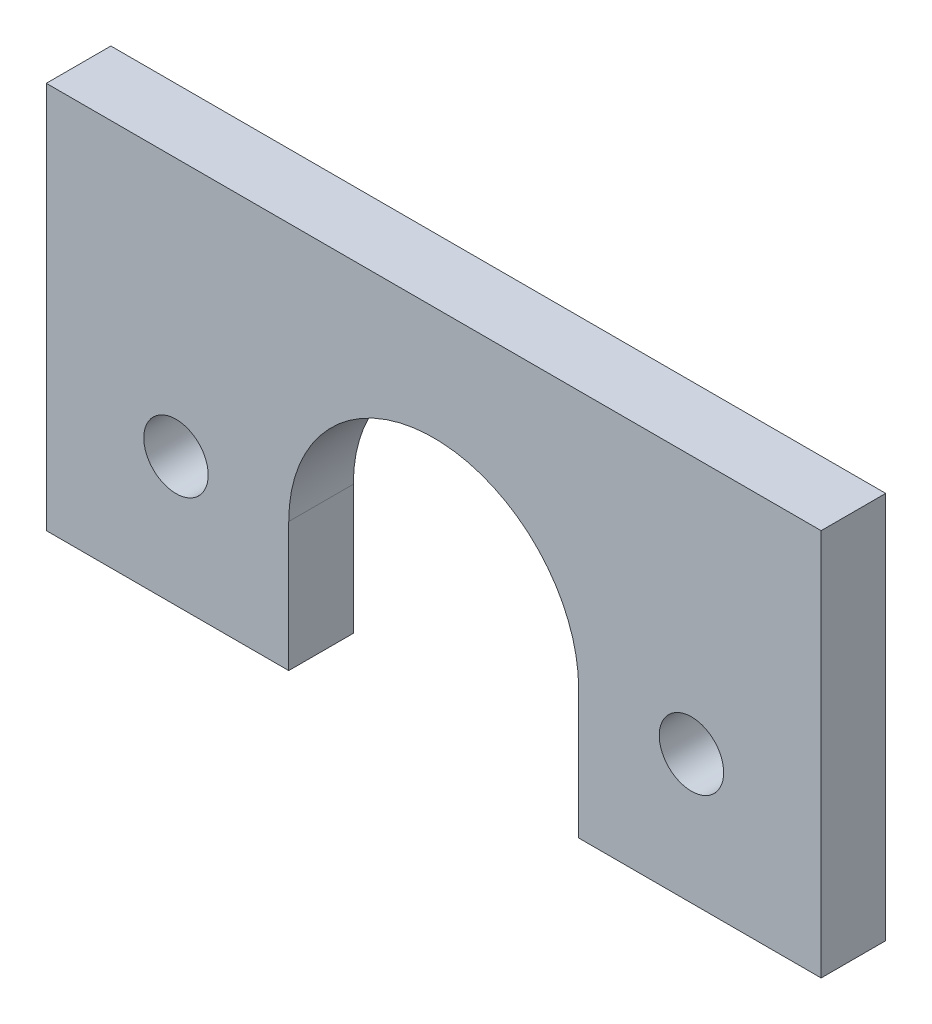
ISO-10303-21;
HEADER;
FILE_DESCRIPTION(('STEP AP214'),'2;1');
FILE_NAME('part.step','',(''),(''),'','','');
FILE_SCHEMA(('AUTOMOTIVE_DESIGN { 1 0 10303 214 1 1 1 1 }'));
ENDSEC;
DATA;
#1=APPLICATION_CONTEXT('core data for automotive mechanical design processes');
#2=APPLICATION_PROTOCOL_DEFINITION('international standard','automotive_design',2000,#1);
#3=PRODUCT_CONTEXT('',#1,'mechanical');
#4=PRODUCT('Part','Part','',(#3));
#5=PRODUCT_RELATED_PRODUCT_CATEGORY('part','',(#4));
#6=PRODUCT_DEFINITION_FORMATION('','',#4);
#7=PRODUCT_DEFINITION_CONTEXT('part definition',#1,'design');
#8=PRODUCT_DEFINITION('design','',#6,#7);
#9=PRODUCT_DEFINITION_SHAPE('','',#8);
#10=(LENGTH_UNIT() NAMED_UNIT(*) SI_UNIT(.MILLI.,.METRE.));
#11=(NAMED_UNIT(*) PLANE_ANGLE_UNIT() SI_UNIT($,.RADIAN.));
#12=(NAMED_UNIT(*) SI_UNIT($,.STERADIAN.) SOLID_ANGLE_UNIT());
#13=UNCERTAINTY_MEASURE_WITH_UNIT(LENGTH_MEASURE(1.E-05),#10,'distance_accuracy_value','');
#14=(GEOMETRIC_REPRESENTATION_CONTEXT(3) GLOBAL_UNCERTAINTY_ASSIGNED_CONTEXT((#13)) GLOBAL_UNIT_ASSIGNED_CONTEXT((#10,
#11,#12)) REPRESENTATION_CONTEXT('',''));
#15=CARTESIAN_POINT('',(0.,0.,0.));
#16=DIRECTION('',(0.,0.,1.));
#17=DIRECTION('',(1.,0.,0.));
#18=AXIS2_PLACEMENT_3D('',#15,#16,#17);
#19=CARTESIAN_POINT('',(-14.2568958463227,0.,6.35));
#20=DIRECTION('',(1.,0.,0.));
#21=DIRECTION('',(0.,1.,0.));
#22=AXIS2_PLACEMENT_3D('',#19,#20,#21);
#23=PLANE('',#22);
#24=DIRECTION('',(0.,-1.,0.));
#25=VECTOR('',#24,1.);
#26=CARTESIAN_POINT('',(-14.2568958463227,0.,0.));
#27=LINE('',#26,#25);
#28=CARTESIAN_POINT('',(-14.2568958463227,0.249783871059959,0.));
#29=VERTEX_POINT('',#28);
#30=CARTESIAN_POINT('',(-14.2568958463227,-12.45021612894,0.));
#31=VERTEX_POINT('',#30);
#32=EDGE_CURVE('E138',#29,#31,#27,.T.);
#33=ORIENTED_EDGE('',*,*,#32,.F.);
#34=DIRECTION('',(0.,0.,-1.));
#35=VECTOR('',#34,1.);
#36=CARTESIAN_POINT('',(-14.2568958463227,0.249783871059959,6.35));
#37=LINE('',#36,#35);
#38=CARTESIAN_POINT('',(-14.2568958463227,0.249783871059959,6.35));
#39=VERTEX_POINT('',#38);
#40=EDGE_CURVE('E11',#39,#29,#37,.T.);
#41=ORIENTED_EDGE('',*,*,#40,.F.);
#42=DIRECTION('',(0.,-1.,0.));
#43=VECTOR('',#42,1.);
#44=CARTESIAN_POINT('',(-14.2568958463227,0.,6.35));
#45=LINE('',#44,#43);
#46=CARTESIAN_POINT('',(-14.2568958463227,-12.45021612894,6.35));
#47=VERTEX_POINT('',#46);
#48=EDGE_CURVE('E161',#39,#47,#45,.T.);
#49=ORIENTED_EDGE('',*,*,#48,.T.);
#50=DIRECTION('',(0.,0.,-1.));
#51=VECTOR('',#50,1.);
#52=CARTESIAN_POINT('',(-14.2568958463227,-12.45021612894,6.35));
#53=LINE('',#52,#51);
#54=EDGE_CURVE('E54',#47,#31,#53,.T.);
#55=ORIENTED_EDGE('',*,*,#54,.T.);
#56=EDGE_LOOP('',(#33,#41,#49,#55));
#57=FACE_BOUND('',#56,.T.);
#58=ADVANCED_FACE('F38',(#57),#23,.T.);
#59=CARTESIAN_POINT('',(0.,0.249783871059959,6.35));
#60=DIRECTION('',(0.,0.,-1.));
#61=DIRECTION('',(-1.,0.,0.));
#62=AXIS2_PLACEMENT_3D('',#59,#60,#61);
#63=CYLINDRICAL_SURFACE('',#62,14.2568958463227);
#64=CARTESIAN_POINT('',(0.,0.249783871059959,0.));
#65=DIRECTION('',(0.,0.,1.));
#66=DIRECTION('',(1.,0.,0.));
#67=AXIS2_PLACEMENT_3D('',#64,#65,#66);
#68=CIRCLE('',#67,14.2568958463227);
#69=CARTESIAN_POINT('',(14.2568958463227,0.249783871059959,0.));
#70=VERTEX_POINT('',#69);
#71=EDGE_CURVE('E140',#29,#70,#68,.F.);
#72=ORIENTED_EDGE('',*,*,#71,.T.);
#73=DIRECTION('',(0.,0.,-1.));
#74=VECTOR('',#73,1.);
#75=CARTESIAN_POINT('',(14.2568958463227,0.249783871059959,6.35));
#76=LINE('',#75,#74);
#77=CARTESIAN_POINT('',(14.2568958463227,0.249783871059959,6.35));
#78=VERTEX_POINT('',#77);
#79=EDGE_CURVE('E46',#78,#70,#76,.T.);
#80=ORIENTED_EDGE('',*,*,#79,.F.);
#81=CARTESIAN_POINT('',(0.,0.249783871059959,6.35));
#82=DIRECTION('',(0.,0.,1.));
#83=DIRECTION('',(1.,0.,0.));
#84=AXIS2_PLACEMENT_3D('',#81,#82,#83);
#85=CIRCLE('',#84,14.2568958463227);
#86=EDGE_CURVE('E195',#39,#78,#85,.F.);
#87=ORIENTED_EDGE('',*,*,#86,.F.);
#88=ORIENTED_EDGE('',*,*,#40,.T.);
#89=EDGE_LOOP('',(#72,#80,#87,#88));
#90=FACE_BOUND('',#89,.T.);
#91=ADVANCED_FACE('F212',(#90),#63,.F.);
#92=CARTESIAN_POINT('',(14.2568958463227,0.,6.35));
#93=DIRECTION('',(1.,0.,0.));
#94=DIRECTION('',(0.,1.,0.));
#95=AXIS2_PLACEMENT_3D('',#92,#93,#94);
#96=PLANE('',#95);
#97=DIRECTION('',(0.,-1.,0.));
#98=VECTOR('',#97,1.);
#99=CARTESIAN_POINT('',(14.2568958463227,0.,0.));
#100=LINE('',#99,#98);
#101=CARTESIAN_POINT('',(14.2568958463227,-12.45021612894,0.));
#102=VERTEX_POINT('',#101);
#103=EDGE_CURVE('E142',#70,#102,#100,.T.);
#104=ORIENTED_EDGE('',*,*,#103,.T.);
#105=DIRECTION('',(0.,0.,-1.));
#106=VECTOR('',#105,1.);
#107=CARTESIAN_POINT('',(14.2568958463227,-12.45021612894,6.35));
#108=LINE('',#107,#106);
#109=CARTESIAN_POINT('',(14.2568958463227,-12.45021612894,6.35));
#110=VERTEX_POINT('',#109);
#111=EDGE_CURVE('E168',#110,#102,#108,.T.);
#112=ORIENTED_EDGE('',*,*,#111,.F.);
#113=DIRECTION('',(0.,-1.,0.));
#114=VECTOR('',#113,1.);
#115=CARTESIAN_POINT('',(14.2568958463227,0.,6.35));
#116=LINE('',#115,#114);
#117=EDGE_CURVE('E177',#78,#110,#116,.T.);
#118=ORIENTED_EDGE('',*,*,#117,.F.);
#119=ORIENTED_EDGE('',*,*,#79,.T.);
#120=EDGE_LOOP('',(#104,#112,#118,#119));
#121=FACE_BOUND('',#120,.T.);
#122=ADVANCED_FACE('F175',(#121),#96,.F.);
#123=CARTESIAN_POINT('',(0.,-12.45021612894,6.35));
#124=DIRECTION('',(0.,1.,0.));
#125=DIRECTION('',(-1.,0.,0.));
#126=AXIS2_PLACEMENT_3D('',#123,#124,#125);
#127=PLANE('',#126);
#128=DIRECTION('',(1.,0.,0.));
#129=VECTOR('',#128,1.);
#130=CARTESIAN_POINT('',(0.,-12.45021612894,0.));
#131=LINE('',#130,#129);
#132=CARTESIAN_POINT('',(38.1,-12.45021612894,0.));
#133=VERTEX_POINT('',#132);
#134=EDGE_CURVE('E144',#102,#133,#131,.T.);
#135=ORIENTED_EDGE('',*,*,#134,.T.);
#136=DIRECTION('',(0.,0.,-1.));
#137=VECTOR('',#136,1.);
#138=CARTESIAN_POINT('',(38.1,-12.45021612894,6.35));
#139=LINE('',#138,#137);
#140=CARTESIAN_POINT('',(38.1,-12.45021612894,6.35));
#141=VERTEX_POINT('',#140);
#142=EDGE_CURVE('E165',#141,#133,#139,.T.);
#143=ORIENTED_EDGE('',*,*,#142,.F.);
#144=DIRECTION('',(1.,0.,0.));
#145=VECTOR('',#144,1.);
#146=CARTESIAN_POINT('',(0.,-12.45021612894,6.35));
#147=LINE('',#146,#145);
#148=EDGE_CURVE('E191',#110,#141,#147,.T.);
#149=ORIENTED_EDGE('',*,*,#148,.F.);
#150=ORIENTED_EDGE('',*,*,#111,.T.);
#151=EDGE_LOOP('',(#135,#143,#149,#150));
#152=FACE_BOUND('',#151,.T.);
#153=ADVANCED_FACE('F187',(#152),#127,.F.);
#154=CARTESIAN_POINT('',(38.1,0.,6.35));
#155=DIRECTION('',(-1.,0.,0.));
#156=DIRECTION('',(0.,0.,1.));
#157=AXIS2_PLACEMENT_3D('',#154,#155,#156);
#158=PLANE('',#157);
#159=DIRECTION('',(0.,1.,0.));
#160=VECTOR('',#159,1.);
#161=CARTESIAN_POINT('',(38.1,0.,0.));
#162=LINE('',#161,#160);
#163=CARTESIAN_POINT('',(38.1,25.64978387106,0.));
#164=VERTEX_POINT('',#163);
#165=EDGE_CURVE('E146',#133,#164,#162,.T.);
#166=ORIENTED_EDGE('',*,*,#165,.T.);
#167=DIRECTION('',(0.,0.,-1.));
#168=VECTOR('',#167,1.);
#169=CARTESIAN_POINT('',(38.1,25.64978387106,6.35));
#170=LINE('',#169,#168);
#171=CARTESIAN_POINT('',(38.1,25.64978387106,6.35));
#172=VERTEX_POINT('',#171);
#173=EDGE_CURVE('E113',#172,#164,#170,.T.);
#174=ORIENTED_EDGE('',*,*,#173,.F.);
#175=DIRECTION('',(0.,1.,0.));
#176=VECTOR('',#175,1.);
#177=CARTESIAN_POINT('',(38.1,0.,6.35));
#178=LINE('',#177,#176);
#179=EDGE_CURVE('E123',#141,#172,#178,.T.);
#180=ORIENTED_EDGE('',*,*,#179,.F.);
#181=ORIENTED_EDGE('',*,*,#142,.T.);
#182=EDGE_LOOP('',(#166,#174,#180,#181));
#183=FACE_BOUND('',#182,.T.);
#184=ADVANCED_FACE('F190',(#183),#158,.F.);
#185=CARTESIAN_POINT('',(0.,25.64978387106,6.35));
#186=DIRECTION('',(0.,1.,0.));
#187=DIRECTION('',(0.,0.,1.));
#188=AXIS2_PLACEMENT_3D('',#185,#186,#187);
#189=PLANE('',#188);
#190=DIRECTION('',(1.,0.,0.));
#191=VECTOR('',#190,1.);
#192=CARTESIAN_POINT('',(0.,25.64978387106,0.));
#193=LINE('',#192,#191);
#194=CARTESIAN_POINT('',(-38.1,25.64978387106,0.));
#195=VERTEX_POINT('',#194);
#196=EDGE_CURVE('E109',#195,#164,#193,.T.);
#197=ORIENTED_EDGE('',*,*,#196,.F.);
#198=DIRECTION('',(0.,0.,-1.));
#199=VECTOR('',#198,1.);
#200=CARTESIAN_POINT('',(-38.1,25.64978387106,6.35));
#201=LINE('',#200,#199);
#202=CARTESIAN_POINT('',(-38.1,25.64978387106,6.35));
#203=VERTEX_POINT('',#202);
#204=EDGE_CURVE('E104',#203,#195,#201,.T.);
#205=ORIENTED_EDGE('',*,*,#204,.F.);
#206=DIRECTION('',(1.,0.,0.));
#207=VECTOR('',#206,1.);
#208=CARTESIAN_POINT('',(0.,25.64978387106,6.35));
#209=LINE('',#208,#207);
#210=EDGE_CURVE('E107',#203,#172,#209,.T.);
#211=ORIENTED_EDGE('',*,*,#210,.T.);
#212=ORIENTED_EDGE('',*,*,#173,.T.);
#213=EDGE_LOOP('',(#197,#205,#211,#212));
#214=FACE_BOUND('',#213,.T.);
#215=ADVANCED_FACE('F106',(#214),#189,.T.);
#216=CARTESIAN_POINT('',(-38.1,0.,6.35));
#217=DIRECTION('',(-1.,0.,0.));
#218=DIRECTION('',(0.,0.,1.));
#219=AXIS2_PLACEMENT_3D('',#216,#217,#218);
#220=PLANE('',#219);
#221=DIRECTION('',(0.,1.,0.));
#222=VECTOR('',#221,1.);
#223=CARTESIAN_POINT('',(-38.1,0.,0.));
#224=LINE('',#223,#222);
#225=CARTESIAN_POINT('',(-38.1,-12.45021612894,0.));
#226=VERTEX_POINT('',#225);
#227=EDGE_CURVE('E150',#226,#195,#224,.T.);
#228=ORIENTED_EDGE('',*,*,#227,.F.);
#229=DIRECTION('',(0.,0.,-1.));
#230=VECTOR('',#229,1.);
#231=CARTESIAN_POINT('',(-38.1,-12.45021612894,6.35));
#232=LINE('',#231,#230);
#233=CARTESIAN_POINT('',(-38.1,-12.45021612894,6.35));
#234=VERTEX_POINT('',#233);
#235=EDGE_CURVE('E79',#234,#226,#232,.T.);
#236=ORIENTED_EDGE('',*,*,#235,.F.);
#237=DIRECTION('',(0.,1.,0.));
#238=VECTOR('',#237,1.);
#239=CARTESIAN_POINT('',(-38.1,0.,6.35));
#240=LINE('',#239,#238);
#241=EDGE_CURVE('E121',#234,#203,#240,.T.);
#242=ORIENTED_EDGE('',*,*,#241,.T.);
#243=ORIENTED_EDGE('',*,*,#204,.T.);
#244=EDGE_LOOP('',(#228,#236,#242,#243));
#245=FACE_BOUND('',#244,.T.);
#246=ADVANCED_FACE('F126',(#245),#220,.T.);
#247=CARTESIAN_POINT('',(-25.3455926156847,0.249783871059959,6.35));
#248=DIRECTION('',(0.,0.,-1.));
#249=DIRECTION('',(-1.,0.,0.));
#250=AXIS2_PLACEMENT_3D('',#247,#248,#249);
#251=CYLINDRICAL_SURFACE('',#250,3.16819907696067);
#252=CARTESIAN_POINT('',(-25.3455926156847,0.249783871059959,6.35));
#253=DIRECTION('',(0.,0.,1.));
#254=DIRECTION('',(1.,0.,0.));
#255=AXIS2_PLACEMENT_3D('',#252,#253,#254);
#256=CIRCLE('',#255,3.16819907696067);
#257=CARTESIAN_POINT('',(-22.177393538724,0.249783871059959,6.35));
#258=VERTEX_POINT('',#257);
#259=EDGE_CURVE('E129',#258,#258,#256,.T.);
#260=ORIENTED_EDGE('',*,*,#259,.T.);
#261=EDGE_LOOP('',(#260));
#262=FACE_BOUND('',#261,.T.);
#263=CARTESIAN_POINT('',(-25.3455926156847,0.249783871059959,0.));
#264=DIRECTION('',(0.,0.,1.));
#265=DIRECTION('',(1.,0.,0.));
#266=AXIS2_PLACEMENT_3D('',#263,#264,#265);
#267=CIRCLE('',#266,3.16819907696067);
#268=CARTESIAN_POINT('',(-22.177393538724,0.249783871059959,0.));
#269=VERTEX_POINT('',#268);
#270=EDGE_CURVE('E155',#269,#269,#267,.T.);
#271=ORIENTED_EDGE('',*,*,#270,.F.);
#272=EDGE_LOOP('',(#271));
#273=FACE_BOUND('',#272,.T.);
#274=ADVANCED_FACE('F200',(#262,#273),#251,.F.);
#275=CARTESIAN_POINT('',(0.,-12.45021612894,6.35));
#276=DIRECTION('',(0.,-1.,0.));
#277=DIRECTION('',(1.,0.,0.));
#278=AXIS2_PLACEMENT_3D('',#275,#276,#277);
#279=PLANE('',#278);
#280=DIRECTION('',(-1.,0.,0.));
#281=VECTOR('',#280,1.);
#282=CARTESIAN_POINT('',(0.,-12.45021612894,0.));
#283=LINE('',#282,#281);
#284=EDGE_CURVE('E152',#31,#226,#283,.T.);
#285=ORIENTED_EDGE('',*,*,#284,.F.);
#286=ORIENTED_EDGE('',*,*,#54,.F.);
#287=DIRECTION('',(-1.,0.,0.));
#288=VECTOR('',#287,1.);
#289=CARTESIAN_POINT('',(0.,-12.45021612894,6.35));
#290=LINE('',#289,#288);
#291=EDGE_CURVE('E127',#47,#234,#290,.T.);
#292=ORIENTED_EDGE('',*,*,#291,.T.);
#293=ORIENTED_EDGE('',*,*,#235,.T.);
#294=EDGE_LOOP('',(#285,#286,#292,#293));
#295=FACE_BOUND('',#294,.T.);
#296=ADVANCED_FACE('F197',(#295),#279,.T.);
#297=CARTESIAN_POINT('',(25.3455926156847,0.249783871059945,6.35));
#298=DIRECTION('',(0.,0.,-1.));
#299=DIRECTION('',(-1.,0.,0.));
#300=AXIS2_PLACEMENT_3D('',#297,#298,#299);
#301=CYLINDRICAL_SURFACE('',#300,3.16819907696068);
#302=CARTESIAN_POINT('',(25.3455926156847,0.249783871059945,6.35));
#303=DIRECTION('',(0.,0.,1.));
#304=DIRECTION('',(1.,0.,0.));
#305=AXIS2_PLACEMENT_3D('',#302,#303,#304);
#306=CIRCLE('',#305,3.16819907696068);
#307=CARTESIAN_POINT('',(28.5137916926454,0.249783871059945,6.35));
#308=VERTEX_POINT('',#307);
#309=EDGE_CURVE('E135',#308,#308,#306,.F.);
#310=ORIENTED_EDGE('',*,*,#309,.F.);
#311=EDGE_LOOP('',(#310));
#312=FACE_BOUND('',#311,.T.);
#313=CARTESIAN_POINT('',(25.3455926156847,0.249783871059945,0.));
#314=DIRECTION('',(0.,0.,1.));
#315=DIRECTION('',(1.,0.,0.));
#316=AXIS2_PLACEMENT_3D('',#313,#314,#315);
#317=CIRCLE('',#316,3.16819907696068);
#318=CARTESIAN_POINT('',(28.5137916926454,0.249783871059945,0.));
#319=VERTEX_POINT('',#318);
#320=EDGE_CURVE('E158',#319,#319,#317,.F.);
#321=ORIENTED_EDGE('',*,*,#320,.T.);
#322=EDGE_LOOP('',(#321));
#323=FACE_BOUND('',#322,.T.);
#324=ADVANCED_FACE('F199',(#312,#323),#301,.F.);
#325=CARTESIAN_POINT('',(0.,0.,6.35));
#326=DIRECTION('',(0.,0.,1.));
#327=DIRECTION('',(1.,0.,0.));
#328=AXIS2_PLACEMENT_3D('',#325,#326,#327);
#329=PLANE('',#328);
#330=ORIENTED_EDGE('',*,*,#48,.F.);
#331=ORIENTED_EDGE('',*,*,#86,.T.);
#332=ORIENTED_EDGE('',*,*,#117,.T.);
#333=ORIENTED_EDGE('',*,*,#148,.T.);
#334=ORIENTED_EDGE('',*,*,#179,.T.);
#335=ORIENTED_EDGE('',*,*,#210,.F.);
#336=ORIENTED_EDGE('',*,*,#241,.F.);
#337=ORIENTED_EDGE('',*,*,#291,.F.);
#338=EDGE_LOOP('',(#330,#331,#332,#333,#334,#335,#336,#337));
#339=FACE_BOUND('',#338,.T.);
#340=ORIENTED_EDGE('',*,*,#259,.F.);
#341=EDGE_LOOP('',(#340));
#342=FACE_BOUND('',#341,.T.);
#343=ORIENTED_EDGE('',*,*,#309,.T.);
#344=EDGE_LOOP('',(#343));
#345=FACE_BOUND('',#344,.T.);
#346=ADVANCED_FACE('F118',(#339,#342,#345),#329,.T.);
#347=CARTESIAN_POINT('',(0.,0.,0.));
#348=DIRECTION('',(0.,0.,1.));
#349=DIRECTION('',(1.,0.,0.));
#350=AXIS2_PLACEMENT_3D('',#347,#348,#349);
#351=PLANE('',#350);
#352=ORIENTED_EDGE('',*,*,#32,.T.);
#353=ORIENTED_EDGE('',*,*,#284,.T.);
#354=ORIENTED_EDGE('',*,*,#227,.T.);
#355=ORIENTED_EDGE('',*,*,#196,.T.);
#356=ORIENTED_EDGE('',*,*,#165,.F.);
#357=ORIENTED_EDGE('',*,*,#134,.F.);
#358=ORIENTED_EDGE('',*,*,#103,.F.);
#359=ORIENTED_EDGE('',*,*,#71,.F.);
#360=EDGE_LOOP('',(#352,#353,#354,#355,#356,#357,#358,#359));
#361=FACE_BOUND('',#360,.T.);
#362=ORIENTED_EDGE('',*,*,#270,.T.);
#363=EDGE_LOOP('',(#362));
#364=FACE_BOUND('',#363,.T.);
#365=ORIENTED_EDGE('',*,*,#320,.F.);
#366=EDGE_LOOP('',(#365));
#367=FACE_BOUND('',#366,.T.);
#368=ADVANCED_FACE('F182',(#361,#364,#367),#351,.F.);
#369=CLOSED_SHELL('',(#58,#91,#122,#153,#184,#215,#246,#274,#296,#324,#346,#368));
#370=MANIFOLD_SOLID_BREP('B2',#369);
#371=ADVANCED_BREP_SHAPE_REPRESENTATION('',(#18,#370),#14);
#372=SHAPE_DEFINITION_REPRESENTATION(#9,#371);
ENDSEC;
END-ISO-10303-21;
